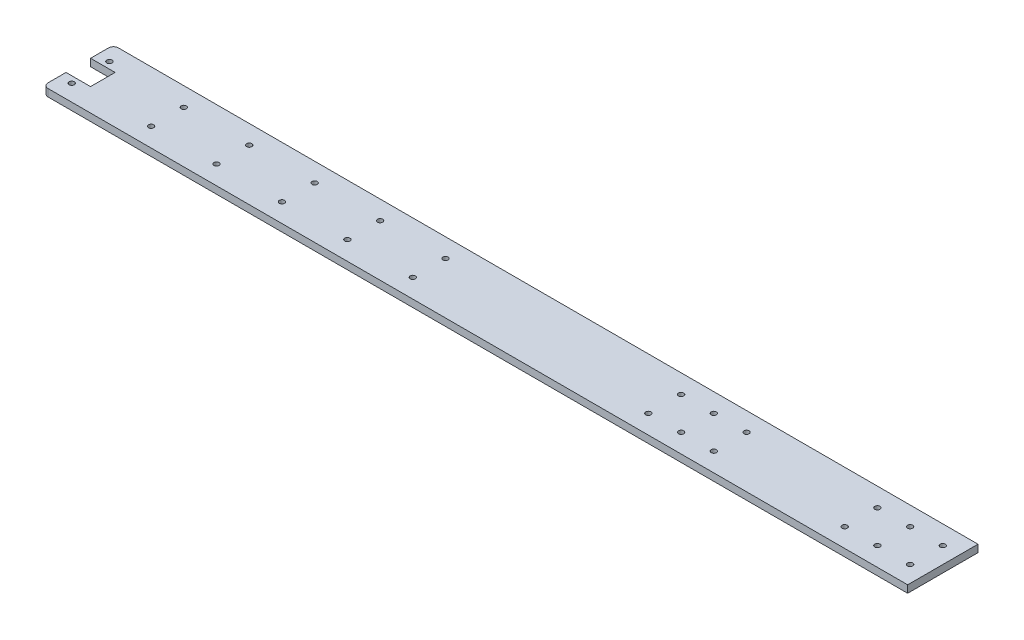
ISO-10303-21;
HEADER;
FILE_DESCRIPTION(('STEP AP214'),'2;1');
FILE_NAME('part.step','',(''),(''),'','','');
FILE_SCHEMA(('AUTOMOTIVE_DESIGN { 1 0 10303 214 1 1 1 1 }'));
ENDSEC;
DATA;
#1=APPLICATION_CONTEXT('core data for automotive mechanical design processes');
#2=APPLICATION_PROTOCOL_DEFINITION('international standard','automotive_design',2000,#1);
#3=PRODUCT_CONTEXT('',#1,'mechanical');
#4=PRODUCT('Part','Part','',(#3));
#5=PRODUCT_RELATED_PRODUCT_CATEGORY('part','',(#4));
#6=PRODUCT_DEFINITION_FORMATION('','',#4);
#7=PRODUCT_DEFINITION_CONTEXT('part definition',#1,'design');
#8=PRODUCT_DEFINITION('design','',#6,#7);
#9=PRODUCT_DEFINITION_SHAPE('','',#8);
#10=(LENGTH_UNIT() NAMED_UNIT(*) SI_UNIT(.MILLI.,.METRE.));
#11=(NAMED_UNIT(*) PLANE_ANGLE_UNIT() SI_UNIT($,.RADIAN.));
#12=(NAMED_UNIT(*) SI_UNIT($,.STERADIAN.) SOLID_ANGLE_UNIT());
#13=UNCERTAINTY_MEASURE_WITH_UNIT(LENGTH_MEASURE(1.E-05),#10,'distance_accuracy_value','');
#14=(GEOMETRIC_REPRESENTATION_CONTEXT(3) GLOBAL_UNCERTAINTY_ASSIGNED_CONTEXT((#13)) GLOBAL_UNIT_ASSIGNED_CONTEXT((#10,
#11,#12)) REPRESENTATION_CONTEXT('',''));
#15=CARTESIAN_POINT('',(0.,0.,0.));
#16=DIRECTION('',(0.,0.,1.));
#17=DIRECTION('',(1.,0.,0.));
#18=AXIS2_PLACEMENT_3D('',#15,#16,#17);
#19=CARTESIAN_POINT('',(-264.25,4.5,21.5000000000001));
#20=DIRECTION('',(1.,0.,0.));
#21=DIRECTION('',(0.,0.,-1.));
#22=AXIS2_PLACEMENT_3D('',#19,#20,#21);
#23=PLANE('',#22);
#24=DIRECTION('',(0.,0.,1.));
#25=VECTOR('',#24,1.);
#26=CARTESIAN_POINT('',(-264.25,4.5,21.5000000000001));
#27=LINE('',#26,#25);
#28=CARTESIAN_POINT('',(-264.25,4.5,-18.5000000000001));
#29=VERTEX_POINT('',#28);
#30=CARTESIAN_POINT('',(-264.25,4.5,-7.5));
#31=VERTEX_POINT('',#30);
#32=EDGE_CURVE('E294',#29,#31,#27,.T.);
#33=ORIENTED_EDGE('',*,*,#32,.F.);
#34=DIRECTION('',(0.,-1.,0.));
#35=VECTOR('',#34,1.);
#36=CARTESIAN_POINT('',(-264.25,4.5,-18.5000000000001));
#37=LINE('',#36,#35);
#38=CARTESIAN_POINT('',(-264.25,0.,-18.5000000000001));
#39=VERTEX_POINT('',#38);
#40=EDGE_CURVE('E41',#29,#39,#37,.T.);
#41=ORIENTED_EDGE('',*,*,#40,.T.);
#42=DIRECTION('',(0.,0.,1.));
#43=VECTOR('',#42,1.);
#44=CARTESIAN_POINT('',(-264.25,0.,21.5000000000001));
#45=LINE('',#44,#43);
#46=CARTESIAN_POINT('',(-264.25,0.,-7.5));
#47=VERTEX_POINT('',#46);
#48=EDGE_CURVE('E303',#39,#47,#45,.T.);
#49=ORIENTED_EDGE('',*,*,#48,.T.);
#50=DIRECTION('',(0.,1.,0.));
#51=VECTOR('',#50,1.);
#52=CARTESIAN_POINT('',(-264.25,0.,-7.5));
#53=LINE('',#52,#51);
#54=EDGE_CURVE('E149',#47,#31,#53,.T.);
#55=ORIENTED_EDGE('',*,*,#54,.T.);
#56=EDGE_LOOP('',(#33,#41,#49,#55));
#57=FACE_BOUND('',#56,.T.);
#58=ADVANCED_FACE('F33',(#57),#23,.F.);
#59=CARTESIAN_POINT('',(0.,4.5,0.));
#60=DIRECTION('',(0.,-1.,0.));
#61=DIRECTION('',(0.,0.,-1.));
#62=AXIS2_PLACEMENT_3D('',#59,#60,#61);
#63=PLANE('',#62);
#64=CARTESIAN_POINT('',(-256.75,4.5,11.5));
#65=DIRECTION('',(0.,1.,0.));
#66=DIRECTION('',(0.,0.,-1.));
#67=AXIS2_PLACEMENT_3D('',#64,#65,#66);
#68=CIRCLE('',#67,1.59999999999996);
#69=CARTESIAN_POINT('',(-256.75,4.5,9.90000000000004));
#70=VERTEX_POINT('',#69);
#71=EDGE_CURVE('E142',#70,#70,#68,.T.);
#72=ORIENTED_EDGE('',*,*,#71,.F.);
#73=EDGE_LOOP('',(#72));
#74=FACE_BOUND('',#73,.T.);
#75=CARTESIAN_POINT('',(-256.75,4.5,-11.5));
#76=DIRECTION('',(0.,1.,0.));
#77=DIRECTION('',(0.,0.,1.));
#78=AXIS2_PLACEMENT_3D('',#75,#76,#77);
#79=CIRCLE('',#78,1.59999999999996);
#80=CARTESIAN_POINT('',(-256.75,4.5,-9.90000000000004));
#81=VERTEX_POINT('',#80);
#82=EDGE_CURVE('E493',#81,#81,#79,.T.);
#83=ORIENTED_EDGE('',*,*,#82,.F.);
#84=EDGE_LOOP('',(#83));
#85=FACE_BOUND('',#84,.T.);
#86=CARTESIAN_POINT('',(-264.25,4.5,7.5));
#87=VERTEX_POINT('',#86);
#88=CARTESIAN_POINT('',(-264.25,4.5,18.5000000000001));
#89=VERTEX_POINT('',#88);
#90=EDGE_CURVE('E293',#87,#89,#27,.T.);
#91=ORIENTED_EDGE('',*,*,#90,.T.);
#92=CARTESIAN_POINT('',(-261.25,4.5,18.5000000000001));
#93=DIRECTION('',(0.,-1.,0.));
#94=DIRECTION('',(0.,0.,-1.));
#95=AXIS2_PLACEMENT_3D('',#92,#93,#94);
#96=CIRCLE('',#95,3.);
#97=CARTESIAN_POINT('',(-261.25,4.5,21.5000000000001));
#98=VERTEX_POINT('',#97);
#99=EDGE_CURVE('E321',#89,#98,#96,.F.);
#100=ORIENTED_EDGE('',*,*,#99,.T.);
#101=DIRECTION('',(1.,0.,0.));
#102=VECTOR('',#101,1.);
#103=CARTESIAN_POINT('',(-264.25,4.5,21.5000000000001));
#104=LINE('',#103,#102);
#105=CARTESIAN_POINT('',(264.25,4.5,21.5000000000001));
#106=VERTEX_POINT('',#105);
#107=EDGE_CURVE('E296',#98,#106,#104,.T.);
#108=ORIENTED_EDGE('',*,*,#107,.T.);
#109=DIRECTION('',(0.,0.,-1.));
#110=VECTOR('',#109,1.);
#111=CARTESIAN_POINT('',(264.25,4.5,21.5000000000001));
#112=LINE('',#111,#110);
#113=CARTESIAN_POINT('',(264.25,4.5,-21.4999999999999));
#114=VERTEX_POINT('',#113);
#115=EDGE_CURVE('E287',#106,#114,#112,.T.);
#116=ORIENTED_EDGE('',*,*,#115,.T.);
#117=DIRECTION('',(-1.,0.,0.));
#118=VECTOR('',#117,1.);
#119=CARTESIAN_POINT('',(-264.25,4.5,-21.5000000000001));
#120=LINE('',#119,#118);
#121=CARTESIAN_POINT('',(-261.25,4.5,-21.5000000000001));
#122=VERTEX_POINT('',#121);
#123=EDGE_CURVE('E290',#114,#122,#120,.T.);
#124=ORIENTED_EDGE('',*,*,#123,.T.);
#125=CARTESIAN_POINT('',(-261.25,4.5,-18.5000000000001));
#126=DIRECTION('',(0.,-1.,0.));
#127=DIRECTION('',(0.,0.,-1.));
#128=AXIS2_PLACEMENT_3D('',#125,#126,#127);
#129=CIRCLE('',#128,3.);
#130=EDGE_CURVE('E53',#122,#29,#129,.F.);
#131=ORIENTED_EDGE('',*,*,#130,.T.);
#132=ORIENTED_EDGE('',*,*,#32,.T.);
#133=DIRECTION('',(-1.,0.,0.));
#134=VECTOR('',#133,1.);
#135=CARTESIAN_POINT('',(-264.25,4.5,-7.5));
#136=LINE('',#135,#134);
#137=CARTESIAN_POINT('',(-249.25,4.5,-7.5));
#138=VERTEX_POINT('',#137);
#139=EDGE_CURVE('E136',#138,#31,#136,.T.);
#140=ORIENTED_EDGE('',*,*,#139,.F.);
#141=DIRECTION('',(0.,0.,-1.));
#142=VECTOR('',#141,1.);
#143=CARTESIAN_POINT('',(-249.25,4.5,7.5));
#144=LINE('',#143,#142);
#145=CARTESIAN_POINT('',(-249.25,4.5,7.5));
#146=VERTEX_POINT('',#145);
#147=EDGE_CURVE('E139',#146,#138,#144,.T.);
#148=ORIENTED_EDGE('',*,*,#147,.F.);
#149=DIRECTION('',(1.,0.,0.));
#150=VECTOR('',#149,1.);
#151=CARTESIAN_POINT('',(-264.25,4.5,7.5));
#152=LINE('',#151,#150);
#153=EDGE_CURVE('E115',#87,#146,#152,.T.);
#154=ORIENTED_EDGE('',*,*,#153,.F.);
#155=EDGE_LOOP('',(#91,#100,#108,#116,#124,#131,#132,#140,#148,#154));
#156=FACE_BOUND('',#155,.T.);
#157=CARTESIAN_POINT('',(-209.75,4.5,-10.));
#158=DIRECTION('',(0.,1.,0.));
#159=DIRECTION('',(0.,0.,1.));
#160=AXIS2_PLACEMENT_3D('',#157,#158,#159);
#161=CIRCLE('',#160,1.59999999999999);
#162=CARTESIAN_POINT('',(-209.75,4.5,-8.40000000000001));
#163=VERTEX_POINT('',#162);
#164=EDGE_CURVE('E281',#163,#163,#161,.T.);
#165=ORIENTED_EDGE('',*,*,#164,.F.);
#166=EDGE_LOOP('',(#165));
#167=FACE_BOUND('',#166,.T.);
#168=CARTESIAN_POINT('',(234.25,4.5,-10.));
#169=DIRECTION('',(0.,1.,0.));
#170=DIRECTION('',(0.,0.,1.));
#171=AXIS2_PLACEMENT_3D('',#168,#169,#170);
#172=CIRCLE('',#171,1.59999999999999);
#173=CARTESIAN_POINT('',(234.25,4.5,-8.40000000000001));
#174=VERTEX_POINT('',#173);
#175=EDGE_CURVE('E275',#174,#174,#172,.T.);
#176=ORIENTED_EDGE('',*,*,#175,.F.);
#177=EDGE_LOOP('',(#176));
#178=FACE_BOUND('',#177,.T.);
#179=CARTESIAN_POINT('',(-169.75,4.5,-10.));
#180=DIRECTION('',(0.,1.,0.));
#181=DIRECTION('',(0.,0.,1.));
#182=AXIS2_PLACEMENT_3D('',#179,#180,#181);
#183=CIRCLE('',#182,1.59999999999999);
#184=CARTESIAN_POINT('',(-169.75,4.5,-8.40000000000001));
#185=VERTEX_POINT('',#184);
#186=EDGE_CURVE('E269',#185,#185,#183,.T.);
#187=ORIENTED_EDGE('',*,*,#186,.F.);
#188=EDGE_LOOP('',(#187));
#189=FACE_BOUND('',#188,.T.);
#190=CARTESIAN_POINT('',(-129.75,4.5,-10.));
#191=DIRECTION('',(0.,1.,0.));
#192=DIRECTION('',(0.,0.,1.));
#193=AXIS2_PLACEMENT_3D('',#190,#191,#192);
#194=CIRCLE('',#193,1.60000000000002);
#195=CARTESIAN_POINT('',(-129.75,4.5,-8.39999999999998));
#196=VERTEX_POINT('',#195);
#197=EDGE_CURVE('E263',#196,#196,#194,.T.);
#198=ORIENTED_EDGE('',*,*,#197,.F.);
#199=EDGE_LOOP('',(#198));
#200=FACE_BOUND('',#199,.T.);
#201=CARTESIAN_POINT('',(-89.7500000000001,4.5,-10.));
#202=DIRECTION('',(0.,1.,0.));
#203=DIRECTION('',(0.,0.,1.));
#204=AXIS2_PLACEMENT_3D('',#201,#202,#203);
#205=CIRCLE('',#204,1.59999999999999);
#206=CARTESIAN_POINT('',(-89.7500000000001,4.5,-8.40000000000001));
#207=VERTEX_POINT('',#206);
#208=EDGE_CURVE('E257',#207,#207,#205,.T.);
#209=ORIENTED_EDGE('',*,*,#208,.F.);
#210=EDGE_LOOP('',(#209));
#211=FACE_BOUND('',#210,.T.);
#212=CARTESIAN_POINT('',(-49.7500000000001,4.5,-10.));
#213=DIRECTION('',(0.,1.,0.));
#214=DIRECTION('',(0.,0.,1.));
#215=AXIS2_PLACEMENT_3D('',#212,#213,#214);
#216=CIRCLE('',#215,1.59999999999996);
#217=CARTESIAN_POINT('',(-49.7500000000001,4.5,-8.40000000000004));
#218=VERTEX_POINT('',#217);
#219=EDGE_CURVE('E251',#218,#218,#216,.T.);
#220=ORIENTED_EDGE('',*,*,#219,.F.);
#221=EDGE_LOOP('',(#220));
#222=FACE_BOUND('',#221,.T.);
#223=CARTESIAN_POINT('',(254.25,4.5,-10.));
#224=DIRECTION('',(0.,1.,0.));
#225=DIRECTION('',(0.,0.,1.));
#226=AXIS2_PLACEMENT_3D('',#223,#224,#225);
#227=CIRCLE('',#226,1.59999999999996);
#228=CARTESIAN_POINT('',(254.25,4.5,-8.40000000000004));
#229=VERTEX_POINT('',#228);
#230=EDGE_CURVE('E245',#229,#229,#227,.T.);
#231=ORIENTED_EDGE('',*,*,#230,.F.);
#232=EDGE_LOOP('',(#231));
#233=FACE_BOUND('',#232,.T.);
#234=CARTESIAN_POINT('',(-169.75,4.5,10.));
#235=DIRECTION('',(0.,1.,0.));
#236=DIRECTION('',(0.,0.,1.));
#237=AXIS2_PLACEMENT_3D('',#234,#235,#236);
#238=CIRCLE('',#237,1.59999999999996);
#239=CARTESIAN_POINT('',(-169.75,4.5,11.6));
#240=VERTEX_POINT('',#239);
#241=EDGE_CURVE('E239',#240,#240,#238,.T.);
#242=ORIENTED_EDGE('',*,*,#241,.F.);
#243=EDGE_LOOP('',(#242));
#244=FACE_BOUND('',#243,.T.);
#245=CARTESIAN_POINT('',(-129.75,4.5,10.));
#246=DIRECTION('',(0.,1.,0.));
#247=DIRECTION('',(0.,0.,1.));
#248=AXIS2_PLACEMENT_3D('',#245,#246,#247);
#249=CIRCLE('',#248,1.60000000000002);
#250=CARTESIAN_POINT('',(-129.75,4.5,11.6));
#251=VERTEX_POINT('',#250);
#252=EDGE_CURVE('E233',#251,#251,#249,.T.);
#253=ORIENTED_EDGE('',*,*,#252,.F.);
#254=EDGE_LOOP('',(#253));
#255=FACE_BOUND('',#254,.T.);
#256=CARTESIAN_POINT('',(-89.7499999999995,4.5,10.));
#257=DIRECTION('',(0.,1.,0.));
#258=DIRECTION('',(0.,0.,1.));
#259=AXIS2_PLACEMENT_3D('',#256,#257,#258);
#260=CIRCLE('',#259,1.59999999999996);
#261=CARTESIAN_POINT('',(-89.7499999999995,4.5,11.6));
#262=VERTEX_POINT('',#261);
#263=EDGE_CURVE('E227',#262,#262,#260,.T.);
#264=ORIENTED_EDGE('',*,*,#263,.F.);
#265=EDGE_LOOP('',(#264));
#266=FACE_BOUND('',#265,.T.);
#267=CARTESIAN_POINT('',(-49.7499999999996,4.5,10.));
#268=DIRECTION('',(0.,1.,0.));
#269=DIRECTION('',(0.,0.,1.));
#270=AXIS2_PLACEMENT_3D('',#267,#268,#269);
#271=CIRCLE('',#270,1.59999999999999);
#272=CARTESIAN_POINT('',(-49.7499999999996,4.5,11.6));
#273=VERTEX_POINT('',#272);
#274=EDGE_CURVE('E221',#273,#273,#271,.T.);
#275=ORIENTED_EDGE('',*,*,#274,.F.);
#276=EDGE_LOOP('',(#275));
#277=FACE_BOUND('',#276,.T.);
#278=CARTESIAN_POINT('',(134.25,4.5,-9.99999999999751));
#279=DIRECTION('',(0.,1.,0.));
#280=DIRECTION('',(0.,0.,1.));
#281=AXIS2_PLACEMENT_3D('',#278,#279,#280);
#282=CIRCLE('',#281,1.59999999999999);
#283=CARTESIAN_POINT('',(134.25,4.5,-8.39999999999752));
#284=VERTEX_POINT('',#283);
#285=EDGE_CURVE('E215',#284,#284,#282,.T.);
#286=ORIENTED_EDGE('',*,*,#285,.F.);
#287=EDGE_LOOP('',(#286));
#288=FACE_BOUND('',#287,.T.);
#289=CARTESIAN_POINT('',(134.25,4.5,10.0000000000025));
#290=DIRECTION('',(0.,1.,0.));
#291=DIRECTION('',(0.,0.,1.));
#292=AXIS2_PLACEMENT_3D('',#289,#290,#291);
#293=CIRCLE('',#292,1.59999999999999);
#294=CARTESIAN_POINT('',(134.25,4.5,11.6000000000025));
#295=VERTEX_POINT('',#294);
#296=EDGE_CURVE('E209',#295,#295,#293,.T.);
#297=ORIENTED_EDGE('',*,*,#296,.F.);
#298=EDGE_LOOP('',(#297));
#299=FACE_BOUND('',#298,.T.);
#300=CARTESIAN_POINT('',(-209.749999999999,4.5,10.));
#301=DIRECTION('',(0.,1.,0.));
#302=DIRECTION('',(0.,0.,1.));
#303=AXIS2_PLACEMENT_3D('',#300,#301,#302);
#304=CIRCLE('',#303,1.59999999999999);
#305=CARTESIAN_POINT('',(-209.749999999999,4.5,11.6));
#306=VERTEX_POINT('',#305);
#307=EDGE_CURVE('E203',#306,#306,#304,.T.);
#308=ORIENTED_EDGE('',*,*,#307,.F.);
#309=EDGE_LOOP('',(#308));
#310=FACE_BOUND('',#309,.T.);
#311=CARTESIAN_POINT('',(114.25,4.5,-9.99999999999751));
#312=DIRECTION('',(0.,1.,0.));
#313=DIRECTION('',(0.,0.,1.));
#314=AXIS2_PLACEMENT_3D('',#311,#312,#313);
#315=CIRCLE('',#314,1.59999999999999);
#316=CARTESIAN_POINT('',(114.25,4.5,-8.39999999999752));
#317=VERTEX_POINT('',#316);
#318=EDGE_CURVE('E197',#317,#317,#315,.T.);
#319=ORIENTED_EDGE('',*,*,#318,.F.);
#320=EDGE_LOOP('',(#319));
#321=FACE_BOUND('',#320,.T.);
#322=CARTESIAN_POINT('',(114.25,4.5,10.0000000000025));
#323=DIRECTION('',(0.,1.,0.));
#324=DIRECTION('',(0.,0.,1.));
#325=AXIS2_PLACEMENT_3D('',#322,#323,#324);
#326=CIRCLE('',#325,1.59999999999999);
#327=CARTESIAN_POINT('',(114.25,4.5,11.6000000000025));
#328=VERTEX_POINT('',#327);
#329=EDGE_CURVE('E191',#328,#328,#326,.T.);
#330=ORIENTED_EDGE('',*,*,#329,.F.);
#331=EDGE_LOOP('',(#330));
#332=FACE_BOUND('',#331,.T.);
#333=CARTESIAN_POINT('',(234.25,4.5,9.99999999999999));
#334=DIRECTION('',(0.,1.,0.));
#335=DIRECTION('',(0.,0.,1.));
#336=AXIS2_PLACEMENT_3D('',#333,#334,#335);
#337=CIRCLE('',#336,1.59999999999999);
#338=CARTESIAN_POINT('',(234.25,4.5,11.6));
#339=VERTEX_POINT('',#338);
#340=EDGE_CURVE('E185',#339,#339,#337,.T.);
#341=ORIENTED_EDGE('',*,*,#340,.F.);
#342=EDGE_LOOP('',(#341));
#343=FACE_BOUND('',#342,.T.);
#344=CARTESIAN_POINT('',(254.25,4.5,9.99999999999999));
#345=DIRECTION('',(0.,1.,0.));
#346=DIRECTION('',(0.,0.,1.));
#347=AXIS2_PLACEMENT_3D('',#344,#345,#346);
#348=CIRCLE('',#347,1.59999999999996);
#349=CARTESIAN_POINT('',(254.25,4.5,11.6));
#350=VERTEX_POINT('',#349);
#351=EDGE_CURVE('E179',#350,#350,#348,.T.);
#352=ORIENTED_EDGE('',*,*,#351,.F.);
#353=EDGE_LOOP('',(#352));
#354=FACE_BOUND('',#353,.T.);
#355=CARTESIAN_POINT('',(214.25,4.5,-9.99999999999986));
#356=DIRECTION('',(0.,1.,0.));
#357=DIRECTION('',(0.,0.,1.));
#358=AXIS2_PLACEMENT_3D('',#355,#356,#357);
#359=CIRCLE('',#358,1.59999999999999);
#360=CARTESIAN_POINT('',(214.25,4.5,-8.39999999999987));
#361=VERTEX_POINT('',#360);
#362=EDGE_CURVE('E173',#361,#361,#359,.T.);
#363=ORIENTED_EDGE('',*,*,#362,.F.);
#364=EDGE_LOOP('',(#363));
#365=FACE_BOUND('',#364,.T.);
#366=CARTESIAN_POINT('',(94.25,4.5,-9.99999999999737));
#367=DIRECTION('',(0.,1.,0.));
#368=DIRECTION('',(0.,0.,1.));
#369=AXIS2_PLACEMENT_3D('',#366,#367,#368);
#370=CIRCLE('',#369,1.59999999999999);
#371=CARTESIAN_POINT('',(94.25,4.5,-8.39999999999738));
#372=VERTEX_POINT('',#371);
#373=EDGE_CURVE('E167',#372,#372,#370,.T.);
#374=ORIENTED_EDGE('',*,*,#373,.F.);
#375=EDGE_LOOP('',(#374));
#376=FACE_BOUND('',#375,.T.);
#377=CARTESIAN_POINT('',(94.2500000000005,4.5,10.0000000000026));
#378=DIRECTION('',(0.,1.,0.));
#379=DIRECTION('',(0.,0.,1.));
#380=AXIS2_PLACEMENT_3D('',#377,#378,#379);
#381=CIRCLE('',#380,1.59999999999999);
#382=CARTESIAN_POINT('',(94.2500000000005,4.5,11.6000000000026));
#383=VERTEX_POINT('',#382);
#384=EDGE_CURVE('E161',#383,#383,#381,.T.);
#385=ORIENTED_EDGE('',*,*,#384,.F.);
#386=EDGE_LOOP('',(#385));
#387=FACE_BOUND('',#386,.T.);
#388=CARTESIAN_POINT('',(214.25,4.5,10.0000000000001));
#389=DIRECTION('',(0.,1.,0.));
#390=DIRECTION('',(0.,0.,1.));
#391=AXIS2_PLACEMENT_3D('',#388,#389,#390);
#392=CIRCLE('',#391,1.59999999999999);
#393=CARTESIAN_POINT('',(214.25,4.5,11.6000000000001));
#394=VERTEX_POINT('',#393);
#395=EDGE_CURVE('E155',#394,#394,#392,.T.);
#396=ORIENTED_EDGE('',*,*,#395,.F.);
#397=EDGE_LOOP('',(#396));
#398=FACE_BOUND('',#397,.T.);
#399=ADVANCED_FACE('F332',(#74,#85,#156,#167,#178,#189,#200,#211,#222,#233,#244,#255,#266,#277,
#288,#299,#310,#321,#332,#343,#354,#365,#376,#387,#398),#63,.F.);
#400=CARTESIAN_POINT('',(0.,0.,0.));
#401=DIRECTION('',(0.,-1.,0.));
#402=DIRECTION('',(0.,0.,-1.));
#403=AXIS2_PLACEMENT_3D('',#400,#401,#402);
#404=PLANE('',#403);
#405=CARTESIAN_POINT('',(-256.75,0.,11.5));
#406=DIRECTION('',(0.,1.,0.));
#407=DIRECTION('',(0.,0.,-1.));
#408=AXIS2_PLACEMENT_3D('',#405,#406,#407);
#409=CIRCLE('',#408,1.59999999999996);
#410=CARTESIAN_POINT('',(-256.75,0.,9.90000000000004));
#411=VERTEX_POINT('',#410);
#412=EDGE_CURVE('E495',#411,#411,#409,.T.);
#413=ORIENTED_EDGE('',*,*,#412,.T.);
#414=EDGE_LOOP('',(#413));
#415=FACE_BOUND('',#414,.T.);
#416=CARTESIAN_POINT('',(-256.75,0.,-11.5));
#417=DIRECTION('',(0.,1.,0.));
#418=DIRECTION('',(0.,0.,1.));
#419=AXIS2_PLACEMENT_3D('',#416,#417,#418);
#420=CIRCLE('',#419,1.59999999999996);
#421=CARTESIAN_POINT('',(-256.75,0.,-9.90000000000004));
#422=VERTEX_POINT('',#421);
#423=EDGE_CURVE('E147',#422,#422,#420,.T.);
#424=ORIENTED_EDGE('',*,*,#423,.T.);
#425=EDGE_LOOP('',(#424));
#426=FACE_BOUND('',#425,.T.);
#427=DIRECTION('',(1.,0.,0.));
#428=VECTOR('',#427,1.);
#429=CARTESIAN_POINT('',(-264.25,0.,21.5000000000001));
#430=LINE('',#429,#428);
#431=CARTESIAN_POINT('',(-261.25,0.,21.5000000000001));
#432=VERTEX_POINT('',#431);
#433=CARTESIAN_POINT('',(264.25,0.,21.5000000000001));
#434=VERTEX_POINT('',#433);
#435=EDGE_CURVE('E291',#432,#434,#430,.T.);
#436=ORIENTED_EDGE('',*,*,#435,.F.);
#437=CARTESIAN_POINT('',(-261.25,0.,18.5000000000001));
#438=DIRECTION('',(0.,-1.,0.));
#439=DIRECTION('',(0.,0.,-1.));
#440=AXIS2_PLACEMENT_3D('',#437,#438,#439);
#441=CIRCLE('',#440,3.);
#442=CARTESIAN_POINT('',(-264.25,0.,18.5000000000001));
#443=VERTEX_POINT('',#442);
#444=EDGE_CURVE('E316',#432,#443,#441,.T.);
#445=ORIENTED_EDGE('',*,*,#444,.T.);
#446=CARTESIAN_POINT('',(-264.25,0.,7.5));
#447=VERTEX_POINT('',#446);
#448=EDGE_CURVE('E135',#447,#443,#45,.T.);
#449=ORIENTED_EDGE('',*,*,#448,.F.);
#450=DIRECTION('',(1.,0.,0.));
#451=VECTOR('',#450,1.);
#452=CARTESIAN_POINT('',(-264.25,0.,7.5));
#453=LINE('',#452,#451);
#454=CARTESIAN_POINT('',(-249.25,0.,7.5));
#455=VERTEX_POINT('',#454);
#456=EDGE_CURVE('E112',#447,#455,#453,.T.);
#457=ORIENTED_EDGE('',*,*,#456,.T.);
#458=DIRECTION('',(0.,0.,-1.));
#459=VECTOR('',#458,1.);
#460=CARTESIAN_POINT('',(-249.25,0.,7.5));
#461=LINE('',#460,#459);
#462=CARTESIAN_POINT('',(-249.25,0.,-7.5));
#463=VERTEX_POINT('',#462);
#464=EDGE_CURVE('E123',#455,#463,#461,.T.);
#465=ORIENTED_EDGE('',*,*,#464,.T.);
#466=DIRECTION('',(-1.,0.,0.));
#467=VECTOR('',#466,1.);
#468=CARTESIAN_POINT('',(-264.25,0.,-7.5));
#469=LINE('',#468,#467);
#470=EDGE_CURVE('E128',#463,#47,#469,.T.);
#471=ORIENTED_EDGE('',*,*,#470,.T.);
#472=ORIENTED_EDGE('',*,*,#48,.F.);
#473=CARTESIAN_POINT('',(-261.25,0.,-18.5000000000001));
#474=DIRECTION('',(0.,-1.,0.));
#475=DIRECTION('',(0.,0.,-1.));
#476=AXIS2_PLACEMENT_3D('',#473,#474,#475);
#477=CIRCLE('',#476,3.);
#478=CARTESIAN_POINT('',(-261.25,0.,-21.5000000000001));
#479=VERTEX_POINT('',#478);
#480=EDGE_CURVE('E314',#39,#479,#477,.T.);
#481=ORIENTED_EDGE('',*,*,#480,.T.);
#482=DIRECTION('',(-1.,0.,0.));
#483=VECTOR('',#482,1.);
#484=CARTESIAN_POINT('',(-264.25,0.,-21.5000000000001));
#485=LINE('',#484,#483);
#486=CARTESIAN_POINT('',(264.25,0.,-21.4999999999999));
#487=VERTEX_POINT('',#486);
#488=EDGE_CURVE('E301',#487,#479,#485,.T.);
#489=ORIENTED_EDGE('',*,*,#488,.F.);
#490=DIRECTION('',(0.,0.,-1.));
#491=VECTOR('',#490,1.);
#492=CARTESIAN_POINT('',(264.25,0.,21.5000000000001));
#493=LINE('',#492,#491);
#494=EDGE_CURVE('E284',#434,#487,#493,.T.);
#495=ORIENTED_EDGE('',*,*,#494,.F.);
#496=EDGE_LOOP('',(#436,#445,#449,#457,#465,#471,#472,#481,#489,#495));
#497=FACE_BOUND('',#496,.T.);
#498=CARTESIAN_POINT('',(94.2500000000005,0.,10.0000000000026));
#499=DIRECTION('',(0.,1.,0.));
#500=DIRECTION('',(0.,0.,1.));
#501=AXIS2_PLACEMENT_3D('',#498,#499,#500);
#502=CIRCLE('',#501,1.59999999999999);
#503=CARTESIAN_POINT('',(94.2500000000005,0.,11.6000000000026));
#504=VERTEX_POINT('',#503);
#505=EDGE_CURVE('E158',#504,#504,#502,.T.);
#506=ORIENTED_EDGE('',*,*,#505,.T.);
#507=EDGE_LOOP('',(#506));
#508=FACE_BOUND('',#507,.T.);
#509=CARTESIAN_POINT('',(214.25,0.,-9.99999999999986));
#510=DIRECTION('',(0.,1.,0.));
#511=DIRECTION('',(0.,0.,1.));
#512=AXIS2_PLACEMENT_3D('',#509,#510,#511);
#513=CIRCLE('',#512,1.59999999999999);
#514=CARTESIAN_POINT('',(214.25,0.,-8.39999999999987));
#515=VERTEX_POINT('',#514);
#516=EDGE_CURVE('E170',#515,#515,#513,.T.);
#517=ORIENTED_EDGE('',*,*,#516,.T.);
#518=EDGE_LOOP('',(#517));
#519=FACE_BOUND('',#518,.T.);
#520=CARTESIAN_POINT('',(234.25,0.,9.99999999999999));
#521=DIRECTION('',(0.,1.,0.));
#522=DIRECTION('',(0.,0.,1.));
#523=AXIS2_PLACEMENT_3D('',#520,#521,#522);
#524=CIRCLE('',#523,1.59999999999999);
#525=CARTESIAN_POINT('',(234.25,0.,11.6));
#526=VERTEX_POINT('',#525);
#527=EDGE_CURVE('E182',#526,#526,#524,.T.);
#528=ORIENTED_EDGE('',*,*,#527,.T.);
#529=EDGE_LOOP('',(#528));
#530=FACE_BOUND('',#529,.T.);
#531=CARTESIAN_POINT('',(114.25,0.,-9.99999999999751));
#532=DIRECTION('',(0.,1.,0.));
#533=DIRECTION('',(0.,0.,1.));
#534=AXIS2_PLACEMENT_3D('',#531,#532,#533);
#535=CIRCLE('',#534,1.59999999999999);
#536=CARTESIAN_POINT('',(114.25,0.,-8.39999999999752));
#537=VERTEX_POINT('',#536);
#538=EDGE_CURVE('E194',#537,#537,#535,.T.);
#539=ORIENTED_EDGE('',*,*,#538,.T.);
#540=EDGE_LOOP('',(#539));
#541=FACE_BOUND('',#540,.T.);
#542=CARTESIAN_POINT('',(134.25,0.,10.0000000000025));
#543=DIRECTION('',(0.,1.,0.));
#544=DIRECTION('',(0.,0.,1.));
#545=AXIS2_PLACEMENT_3D('',#542,#543,#544);
#546=CIRCLE('',#545,1.59999999999999);
#547=CARTESIAN_POINT('',(134.25,0.,11.6000000000025));
#548=VERTEX_POINT('',#547);
#549=EDGE_CURVE('E206',#548,#548,#546,.T.);
#550=ORIENTED_EDGE('',*,*,#549,.T.);
#551=EDGE_LOOP('',(#550));
#552=FACE_BOUND('',#551,.T.);
#553=CARTESIAN_POINT('',(-49.7499999999996,0.,10.));
#554=DIRECTION('',(0.,1.,0.));
#555=DIRECTION('',(0.,0.,1.));
#556=AXIS2_PLACEMENT_3D('',#553,#554,#555);
#557=CIRCLE('',#556,1.59999999999999);
#558=CARTESIAN_POINT('',(-49.7499999999996,0.,11.6));
#559=VERTEX_POINT('',#558);
#560=EDGE_CURVE('E218',#559,#559,#557,.T.);
#561=ORIENTED_EDGE('',*,*,#560,.T.);
#562=EDGE_LOOP('',(#561));
#563=FACE_BOUND('',#562,.T.);
#564=CARTESIAN_POINT('',(-129.75,0.,10.));
#565=DIRECTION('',(0.,1.,0.));
#566=DIRECTION('',(0.,0.,1.));
#567=AXIS2_PLACEMENT_3D('',#564,#565,#566);
#568=CIRCLE('',#567,1.60000000000002);
#569=CARTESIAN_POINT('',(-129.75,0.,11.6));
#570=VERTEX_POINT('',#569);
#571=EDGE_CURVE('E230',#570,#570,#568,.T.);
#572=ORIENTED_EDGE('',*,*,#571,.T.);
#573=EDGE_LOOP('',(#572));
#574=FACE_BOUND('',#573,.T.);
#575=CARTESIAN_POINT('',(254.25,0.,-10.));
#576=DIRECTION('',(0.,1.,0.));
#577=DIRECTION('',(0.,0.,1.));
#578=AXIS2_PLACEMENT_3D('',#575,#576,#577);
#579=CIRCLE('',#578,1.59999999999996);
#580=CARTESIAN_POINT('',(254.25,0.,-8.40000000000004));
#581=VERTEX_POINT('',#580);
#582=EDGE_CURVE('E242',#581,#581,#579,.T.);
#583=ORIENTED_EDGE('',*,*,#582,.T.);
#584=EDGE_LOOP('',(#583));
#585=FACE_BOUND('',#584,.T.);
#586=CARTESIAN_POINT('',(-89.7500000000001,0.,-10.));
#587=DIRECTION('',(0.,1.,0.));
#588=DIRECTION('',(0.,0.,1.));
#589=AXIS2_PLACEMENT_3D('',#586,#587,#588);
#590=CIRCLE('',#589,1.59999999999999);
#591=CARTESIAN_POINT('',(-89.7500000000001,0.,-8.40000000000001));
#592=VERTEX_POINT('',#591);
#593=EDGE_CURVE('E254',#592,#592,#590,.T.);
#594=ORIENTED_EDGE('',*,*,#593,.T.);
#595=EDGE_LOOP('',(#594));
#596=FACE_BOUND('',#595,.T.);
#597=CARTESIAN_POINT('',(-169.75,0.,-10.));
#598=DIRECTION('',(0.,1.,0.));
#599=DIRECTION('',(0.,0.,1.));
#600=AXIS2_PLACEMENT_3D('',#597,#598,#599);
#601=CIRCLE('',#600,1.59999999999999);
#602=CARTESIAN_POINT('',(-169.75,0.,-8.40000000000001));
#603=VERTEX_POINT('',#602);
#604=EDGE_CURVE('E266',#603,#603,#601,.T.);
#605=ORIENTED_EDGE('',*,*,#604,.T.);
#606=EDGE_LOOP('',(#605));
#607=FACE_BOUND('',#606,.T.);
#608=CARTESIAN_POINT('',(-209.75,0.,-10.));
#609=DIRECTION('',(0.,1.,0.));
#610=DIRECTION('',(0.,0.,1.));
#611=AXIS2_PLACEMENT_3D('',#608,#609,#610);
#612=CIRCLE('',#611,1.59999999999999);
#613=CARTESIAN_POINT('',(-209.75,0.,-8.40000000000001));
#614=VERTEX_POINT('',#613);
#615=EDGE_CURVE('E278',#614,#614,#612,.T.);
#616=ORIENTED_EDGE('',*,*,#615,.T.);
#617=EDGE_LOOP('',(#616));
#618=FACE_BOUND('',#617,.T.);
#619=CARTESIAN_POINT('',(234.25,0.,-10.));
#620=DIRECTION('',(0.,1.,0.));
#621=DIRECTION('',(0.,0.,1.));
#622=AXIS2_PLACEMENT_3D('',#619,#620,#621);
#623=CIRCLE('',#622,1.59999999999999);
#624=CARTESIAN_POINT('',(234.25,0.,-8.40000000000001));
#625=VERTEX_POINT('',#624);
#626=EDGE_CURVE('E272',#625,#625,#623,.T.);
#627=ORIENTED_EDGE('',*,*,#626,.T.);
#628=EDGE_LOOP('',(#627));
#629=FACE_BOUND('',#628,.T.);
#630=CARTESIAN_POINT('',(-129.75,0.,-10.));
#631=DIRECTION('',(0.,1.,0.));
#632=DIRECTION('',(0.,0.,1.));
#633=AXIS2_PLACEMENT_3D('',#630,#631,#632);
#634=CIRCLE('',#633,1.60000000000002);
#635=CARTESIAN_POINT('',(-129.75,0.,-8.39999999999998));
#636=VERTEX_POINT('',#635);
#637=EDGE_CURVE('E260',#636,#636,#634,.T.);
#638=ORIENTED_EDGE('',*,*,#637,.T.);
#639=EDGE_LOOP('',(#638));
#640=FACE_BOUND('',#639,.T.);
#641=CARTESIAN_POINT('',(-49.7500000000001,0.,-10.));
#642=DIRECTION('',(0.,1.,0.));
#643=DIRECTION('',(0.,0.,1.));
#644=AXIS2_PLACEMENT_3D('',#641,#642,#643);
#645=CIRCLE('',#644,1.59999999999996);
#646=CARTESIAN_POINT('',(-49.7500000000001,0.,-8.40000000000004));
#647=VERTEX_POINT('',#646);
#648=EDGE_CURVE('E248',#647,#647,#645,.T.);
#649=ORIENTED_EDGE('',*,*,#648,.T.);
#650=EDGE_LOOP('',(#649));
#651=FACE_BOUND('',#650,.T.);
#652=CARTESIAN_POINT('',(-169.75,0.,10.));
#653=DIRECTION('',(0.,1.,0.));
#654=DIRECTION('',(0.,0.,1.));
#655=AXIS2_PLACEMENT_3D('',#652,#653,#654);
#656=CIRCLE('',#655,1.59999999999996);
#657=CARTESIAN_POINT('',(-169.75,0.,11.6));
#658=VERTEX_POINT('',#657);
#659=EDGE_CURVE('E236',#658,#658,#656,.T.);
#660=ORIENTED_EDGE('',*,*,#659,.T.);
#661=EDGE_LOOP('',(#660));
#662=FACE_BOUND('',#661,.T.);
#663=CARTESIAN_POINT('',(-89.7499999999995,0.,10.));
#664=DIRECTION('',(0.,1.,0.));
#665=DIRECTION('',(0.,0.,1.));
#666=AXIS2_PLACEMENT_3D('',#663,#664,#665);
#667=CIRCLE('',#666,1.59999999999996);
#668=CARTESIAN_POINT('',(-89.7499999999995,0.,11.6));
#669=VERTEX_POINT('',#668);
#670=EDGE_CURVE('E224',#669,#669,#667,.T.);
#671=ORIENTED_EDGE('',*,*,#670,.T.);
#672=EDGE_LOOP('',(#671));
#673=FACE_BOUND('',#672,.T.);
#674=CARTESIAN_POINT('',(134.25,0.,-9.99999999999751));
#675=DIRECTION('',(0.,1.,0.));
#676=DIRECTION('',(0.,0.,1.));
#677=AXIS2_PLACEMENT_3D('',#674,#675,#676);
#678=CIRCLE('',#677,1.59999999999999);
#679=CARTESIAN_POINT('',(134.25,0.,-8.39999999999752));
#680=VERTEX_POINT('',#679);
#681=EDGE_CURVE('E212',#680,#680,#678,.T.);
#682=ORIENTED_EDGE('',*,*,#681,.T.);
#683=EDGE_LOOP('',(#682));
#684=FACE_BOUND('',#683,.T.);
#685=CARTESIAN_POINT('',(-209.749999999999,0.,10.));
#686=DIRECTION('',(0.,1.,0.));
#687=DIRECTION('',(0.,0.,1.));
#688=AXIS2_PLACEMENT_3D('',#685,#686,#687);
#689=CIRCLE('',#688,1.59999999999999);
#690=CARTESIAN_POINT('',(-209.749999999999,0.,11.6));
#691=VERTEX_POINT('',#690);
#692=EDGE_CURVE('E200',#691,#691,#689,.T.);
#693=ORIENTED_EDGE('',*,*,#692,.T.);
#694=EDGE_LOOP('',(#693));
#695=FACE_BOUND('',#694,.T.);
#696=CARTESIAN_POINT('',(114.25,0.,10.0000000000025));
#697=DIRECTION('',(0.,1.,0.));
#698=DIRECTION('',(0.,0.,1.));
#699=AXIS2_PLACEMENT_3D('',#696,#697,#698);
#700=CIRCLE('',#699,1.59999999999999);
#701=CARTESIAN_POINT('',(114.25,0.,11.6000000000025));
#702=VERTEX_POINT('',#701);
#703=EDGE_CURVE('E188',#702,#702,#700,.T.);
#704=ORIENTED_EDGE('',*,*,#703,.T.);
#705=EDGE_LOOP('',(#704));
#706=FACE_BOUND('',#705,.T.);
#707=CARTESIAN_POINT('',(254.25,0.,9.99999999999999));
#708=DIRECTION('',(0.,1.,0.));
#709=DIRECTION('',(0.,0.,1.));
#710=AXIS2_PLACEMENT_3D('',#707,#708,#709);
#711=CIRCLE('',#710,1.59999999999996);
#712=CARTESIAN_POINT('',(254.25,0.,11.6));
#713=VERTEX_POINT('',#712);
#714=EDGE_CURVE('E176',#713,#713,#711,.T.);
#715=ORIENTED_EDGE('',*,*,#714,.T.);
#716=EDGE_LOOP('',(#715));
#717=FACE_BOUND('',#716,.T.);
#718=CARTESIAN_POINT('',(94.25,0.,-9.99999999999737));
#719=DIRECTION('',(0.,1.,0.));
#720=DIRECTION('',(0.,0.,1.));
#721=AXIS2_PLACEMENT_3D('',#718,#719,#720);
#722=CIRCLE('',#721,1.59999999999999);
#723=CARTESIAN_POINT('',(94.25,0.,-8.39999999999738));
#724=VERTEX_POINT('',#723);
#725=EDGE_CURVE('E164',#724,#724,#722,.T.);
#726=ORIENTED_EDGE('',*,*,#725,.T.);
#727=EDGE_LOOP('',(#726));
#728=FACE_BOUND('',#727,.T.);
#729=CARTESIAN_POINT('',(214.25,0.,10.0000000000001));
#730=DIRECTION('',(0.,1.,0.));
#731=DIRECTION('',(0.,0.,1.));
#732=AXIS2_PLACEMENT_3D('',#729,#730,#731);
#733=CIRCLE('',#732,1.59999999999999);
#734=CARTESIAN_POINT('',(214.25,0.,11.6000000000001));
#735=VERTEX_POINT('',#734);
#736=EDGE_CURVE('E152',#735,#735,#733,.T.);
#737=ORIENTED_EDGE('',*,*,#736,.T.);
#738=EDGE_LOOP('',(#737));
#739=FACE_BOUND('',#738,.T.);
#740=ADVANCED_FACE('F132',(#415,#426,#497,#508,#519,#530,#541,#552,#563,#574,#585,#596,#607,
#618,#629,#640,#651,#662,#673,#684,#695,#706,#717,#728,#739),#404,.T.);
#741=CARTESIAN_POINT('',(264.25,4.5,21.5000000000001));
#742=DIRECTION('',(-1.,0.,0.));
#743=DIRECTION('',(0.,0.,1.));
#744=AXIS2_PLACEMENT_3D('',#741,#742,#743);
#745=PLANE('',#744);
#746=ORIENTED_EDGE('',*,*,#494,.T.);
#747=DIRECTION('',(0.,-1.,0.));
#748=VECTOR('',#747,1.);
#749=CARTESIAN_POINT('',(264.25,4.5,-21.4999999999999));
#750=LINE('',#749,#748);
#751=EDGE_CURVE('E308',#114,#487,#750,.T.);
#752=ORIENTED_EDGE('',*,*,#751,.F.);
#753=ORIENTED_EDGE('',*,*,#115,.F.);
#754=DIRECTION('',(0.,-1.,0.));
#755=VECTOR('',#754,1.);
#756=CARTESIAN_POINT('',(264.25,4.5,21.5000000000001));
#757=LINE('',#756,#755);
#758=EDGE_CURVE('E298',#106,#434,#757,.T.);
#759=ORIENTED_EDGE('',*,*,#758,.T.);
#760=EDGE_LOOP('',(#746,#752,#753,#759));
#761=FACE_BOUND('',#760,.T.);
#762=ADVANCED_FACE('F350',(#761),#745,.F.);
#763=CARTESIAN_POINT('',(-264.25,4.5,-21.5000000000001));
#764=DIRECTION('',(0.,0.,1.));
#765=DIRECTION('',(1.,0.,0.));
#766=AXIS2_PLACEMENT_3D('',#763,#764,#765);
#767=PLANE('',#766);
#768=ORIENTED_EDGE('',*,*,#488,.T.);
#769=DIRECTION('',(0.,-1.,0.));
#770=VECTOR('',#769,1.);
#771=CARTESIAN_POINT('',(-261.25,4.5,-21.5000000000001));
#772=LINE('',#771,#770);
#773=EDGE_CURVE('E11',#479,#122,#772,.F.);
#774=ORIENTED_EDGE('',*,*,#773,.T.);
#775=ORIENTED_EDGE('',*,*,#123,.F.);
#776=ORIENTED_EDGE('',*,*,#751,.T.);
#777=EDGE_LOOP('',(#768,#774,#775,#776));
#778=FACE_BOUND('',#777,.T.);
#779=ADVANCED_FACE('F367',(#778),#767,.F.);
#780=ORIENTED_EDGE('',*,*,#448,.T.);
#781=DIRECTION('',(0.,-1.,0.));
#782=VECTOR('',#781,1.);
#783=CARTESIAN_POINT('',(-264.25,4.5,18.5000000000001));
#784=LINE('',#783,#782);
#785=EDGE_CURVE('E318',#443,#89,#784,.F.);
#786=ORIENTED_EDGE('',*,*,#785,.T.);
#787=ORIENTED_EDGE('',*,*,#90,.F.);
#788=DIRECTION('',(0.,1.,0.));
#789=VECTOR('',#788,1.);
#790=CARTESIAN_POINT('',(-264.25,0.,7.5));
#791=LINE('',#790,#789);
#792=EDGE_CURVE('E120',#447,#87,#791,.T.);
#793=ORIENTED_EDGE('',*,*,#792,.F.);
#794=EDGE_LOOP('',(#780,#786,#787,#793));
#795=FACE_BOUND('',#794,.T.);
#796=ADVANCED_FACE('F337',(#795),#23,.F.);
#797=CARTESIAN_POINT('',(-264.25,4.5,21.5000000000001));
#798=DIRECTION('',(0.,0.,-1.));
#799=DIRECTION('',(-1.,0.,0.));
#800=AXIS2_PLACEMENT_3D('',#797,#798,#799);
#801=PLANE('',#800);
#802=ORIENTED_EDGE('',*,*,#107,.F.);
#803=DIRECTION('',(0.,-1.,0.));
#804=VECTOR('',#803,1.);
#805=CARTESIAN_POINT('',(-261.25,4.5,21.5000000000001));
#806=LINE('',#805,#804);
#807=EDGE_CURVE('E311',#98,#432,#806,.T.);
#808=ORIENTED_EDGE('',*,*,#807,.T.);
#809=ORIENTED_EDGE('',*,*,#435,.T.);
#810=ORIENTED_EDGE('',*,*,#758,.F.);
#811=EDGE_LOOP('',(#802,#808,#809,#810));
#812=FACE_BOUND('',#811,.T.);
#813=ADVANCED_FACE('F345',(#812),#801,.F.);
#814=CARTESIAN_POINT('',(-209.75,4.5,-10.));
#815=DIRECTION('',(0.,-1.,0.));
#816=DIRECTION('',(0.,0.,-1.));
#817=AXIS2_PLACEMENT_3D('',#814,#815,#816);
#818=CYLINDRICAL_SURFACE('',#817,1.59999999999999);
#819=ORIENTED_EDGE('',*,*,#164,.T.);
#820=EDGE_LOOP('',(#819));
#821=FACE_BOUND('',#820,.T.);
#822=ORIENTED_EDGE('',*,*,#615,.F.);
#823=EDGE_LOOP('',(#822));
#824=FACE_BOUND('',#823,.T.);
#825=ADVANCED_FACE('F372',(#821,#824),#818,.F.);
#826=CARTESIAN_POINT('',(234.25,4.5,-10.));
#827=DIRECTION('',(0.,-1.,0.));
#828=DIRECTION('',(0.,0.,-1.));
#829=AXIS2_PLACEMENT_3D('',#826,#827,#828);
#830=CYLINDRICAL_SURFACE('',#829,1.59999999999999);
#831=ORIENTED_EDGE('',*,*,#175,.T.);
#832=EDGE_LOOP('',(#831));
#833=FACE_BOUND('',#832,.T.);
#834=ORIENTED_EDGE('',*,*,#626,.F.);
#835=EDGE_LOOP('',(#834));
#836=FACE_BOUND('',#835,.T.);
#837=ADVANCED_FACE('F389',(#833,#836),#830,.F.);
#838=CARTESIAN_POINT('',(-169.75,4.5,-10.));
#839=DIRECTION('',(0.,-1.,0.));
#840=DIRECTION('',(0.,0.,-1.));
#841=AXIS2_PLACEMENT_3D('',#838,#839,#840);
#842=CYLINDRICAL_SURFACE('',#841,1.59999999999999);
#843=ORIENTED_EDGE('',*,*,#186,.T.);
#844=EDGE_LOOP('',(#843));
#845=FACE_BOUND('',#844,.T.);
#846=ORIENTED_EDGE('',*,*,#604,.F.);
#847=EDGE_LOOP('',(#846));
#848=FACE_BOUND('',#847,.T.);
#849=ADVANCED_FACE('F393',(#845,#848),#842,.F.);
#850=CARTESIAN_POINT('',(-129.75,4.5,-10.));
#851=DIRECTION('',(0.,-1.,0.));
#852=DIRECTION('',(0.,0.,-1.));
#853=AXIS2_PLACEMENT_3D('',#850,#851,#852);
#854=CYLINDRICAL_SURFACE('',#853,1.60000000000002);
#855=ORIENTED_EDGE('',*,*,#197,.T.);
#856=EDGE_LOOP('',(#855));
#857=FACE_BOUND('',#856,.T.);
#858=ORIENTED_EDGE('',*,*,#637,.F.);
#859=EDGE_LOOP('',(#858));
#860=FACE_BOUND('',#859,.T.);
#861=ADVANCED_FACE('F397',(#857,#860),#854,.F.);
#862=CARTESIAN_POINT('',(-89.7500000000001,4.5,-10.));
#863=DIRECTION('',(0.,-1.,0.));
#864=DIRECTION('',(0.,0.,-1.));
#865=AXIS2_PLACEMENT_3D('',#862,#863,#864);
#866=CYLINDRICAL_SURFACE('',#865,1.59999999999999);
#867=ORIENTED_EDGE('',*,*,#208,.T.);
#868=EDGE_LOOP('',(#867));
#869=FACE_BOUND('',#868,.T.);
#870=ORIENTED_EDGE('',*,*,#593,.F.);
#871=EDGE_LOOP('',(#870));
#872=FACE_BOUND('',#871,.T.);
#873=ADVANCED_FACE('F401',(#869,#872),#866,.F.);
#874=CARTESIAN_POINT('',(-49.7500000000001,4.5,-10.));
#875=DIRECTION('',(0.,-1.,0.));
#876=DIRECTION('',(0.,0.,-1.));
#877=AXIS2_PLACEMENT_3D('',#874,#875,#876);
#878=CYLINDRICAL_SURFACE('',#877,1.59999999999996);
#879=ORIENTED_EDGE('',*,*,#219,.T.);
#880=EDGE_LOOP('',(#879));
#881=FACE_BOUND('',#880,.T.);
#882=ORIENTED_EDGE('',*,*,#648,.F.);
#883=EDGE_LOOP('',(#882));
#884=FACE_BOUND('',#883,.T.);
#885=ADVANCED_FACE('F405',(#881,#884),#878,.F.);
#886=CARTESIAN_POINT('',(254.25,4.5,-10.));
#887=DIRECTION('',(0.,-1.,0.));
#888=DIRECTION('',(0.,0.,-1.));
#889=AXIS2_PLACEMENT_3D('',#886,#887,#888);
#890=CYLINDRICAL_SURFACE('',#889,1.59999999999996);
#891=ORIENTED_EDGE('',*,*,#230,.T.);
#892=EDGE_LOOP('',(#891));
#893=FACE_BOUND('',#892,.T.);
#894=ORIENTED_EDGE('',*,*,#582,.F.);
#895=EDGE_LOOP('',(#894));
#896=FACE_BOUND('',#895,.T.);
#897=ADVANCED_FACE('F409',(#893,#896),#890,.F.);
#898=CARTESIAN_POINT('',(-169.75,4.5,10.));
#899=DIRECTION('',(0.,-1.,0.));
#900=DIRECTION('',(0.,0.,-1.));
#901=AXIS2_PLACEMENT_3D('',#898,#899,#900);
#902=CYLINDRICAL_SURFACE('',#901,1.59999999999996);
#903=ORIENTED_EDGE('',*,*,#241,.T.);
#904=EDGE_LOOP('',(#903));
#905=FACE_BOUND('',#904,.T.);
#906=ORIENTED_EDGE('',*,*,#659,.F.);
#907=EDGE_LOOP('',(#906));
#908=FACE_BOUND('',#907,.T.);
#909=ADVANCED_FACE('F413',(#905,#908),#902,.F.);
#910=CARTESIAN_POINT('',(-129.75,4.5,10.));
#911=DIRECTION('',(0.,-1.,0.));
#912=DIRECTION('',(0.,0.,-1.));
#913=AXIS2_PLACEMENT_3D('',#910,#911,#912);
#914=CYLINDRICAL_SURFACE('',#913,1.60000000000002);
#915=ORIENTED_EDGE('',*,*,#252,.T.);
#916=EDGE_LOOP('',(#915));
#917=FACE_BOUND('',#916,.T.);
#918=ORIENTED_EDGE('',*,*,#571,.F.);
#919=EDGE_LOOP('',(#918));
#920=FACE_BOUND('',#919,.T.);
#921=ADVANCED_FACE('F417',(#917,#920),#914,.F.);
#922=CARTESIAN_POINT('',(-89.7499999999995,4.5,10.));
#923=DIRECTION('',(0.,-1.,0.));
#924=DIRECTION('',(0.,0.,-1.));
#925=AXIS2_PLACEMENT_3D('',#922,#923,#924);
#926=CYLINDRICAL_SURFACE('',#925,1.59999999999996);
#927=ORIENTED_EDGE('',*,*,#263,.T.);
#928=EDGE_LOOP('',(#927));
#929=FACE_BOUND('',#928,.T.);
#930=ORIENTED_EDGE('',*,*,#670,.F.);
#931=EDGE_LOOP('',(#930));
#932=FACE_BOUND('',#931,.T.);
#933=ADVANCED_FACE('F421',(#929,#932),#926,.F.);
#934=CARTESIAN_POINT('',(-49.7499999999996,4.5,10.));
#935=DIRECTION('',(0.,-1.,0.));
#936=DIRECTION('',(0.,0.,-1.));
#937=AXIS2_PLACEMENT_3D('',#934,#935,#936);
#938=CYLINDRICAL_SURFACE('',#937,1.59999999999999);
#939=ORIENTED_EDGE('',*,*,#274,.T.);
#940=EDGE_LOOP('',(#939));
#941=FACE_BOUND('',#940,.T.);
#942=ORIENTED_EDGE('',*,*,#560,.F.);
#943=EDGE_LOOP('',(#942));
#944=FACE_BOUND('',#943,.T.);
#945=ADVANCED_FACE('F425',(#941,#944),#938,.F.);
#946=CARTESIAN_POINT('',(134.25,4.5,-9.99999999999751));
#947=DIRECTION('',(0.,-1.,0.));
#948=DIRECTION('',(0.,0.,-1.));
#949=AXIS2_PLACEMENT_3D('',#946,#947,#948);
#950=CYLINDRICAL_SURFACE('',#949,1.59999999999999);
#951=ORIENTED_EDGE('',*,*,#285,.T.);
#952=EDGE_LOOP('',(#951));
#953=FACE_BOUND('',#952,.T.);
#954=ORIENTED_EDGE('',*,*,#681,.F.);
#955=EDGE_LOOP('',(#954));
#956=FACE_BOUND('',#955,.T.);
#957=ADVANCED_FACE('F429',(#953,#956),#950,.F.);
#958=CARTESIAN_POINT('',(134.25,4.5,10.0000000000025));
#959=DIRECTION('',(0.,-1.,0.));
#960=DIRECTION('',(0.,0.,-1.));
#961=AXIS2_PLACEMENT_3D('',#958,#959,#960);
#962=CYLINDRICAL_SURFACE('',#961,1.59999999999999);
#963=ORIENTED_EDGE('',*,*,#296,.T.);
#964=EDGE_LOOP('',(#963));
#965=FACE_BOUND('',#964,.T.);
#966=ORIENTED_EDGE('',*,*,#549,.F.);
#967=EDGE_LOOP('',(#966));
#968=FACE_BOUND('',#967,.T.);
#969=ADVANCED_FACE('F433',(#965,#968),#962,.F.);
#970=CARTESIAN_POINT('',(-209.749999999999,4.5,10.));
#971=DIRECTION('',(0.,-1.,0.));
#972=DIRECTION('',(0.,0.,-1.));
#973=AXIS2_PLACEMENT_3D('',#970,#971,#972);
#974=CYLINDRICAL_SURFACE('',#973,1.59999999999999);
#975=ORIENTED_EDGE('',*,*,#307,.T.);
#976=EDGE_LOOP('',(#975));
#977=FACE_BOUND('',#976,.T.);
#978=ORIENTED_EDGE('',*,*,#692,.F.);
#979=EDGE_LOOP('',(#978));
#980=FACE_BOUND('',#979,.T.);
#981=ADVANCED_FACE('F437',(#977,#980),#974,.F.);
#982=CARTESIAN_POINT('',(114.25,4.5,-9.99999999999751));
#983=DIRECTION('',(0.,-1.,0.));
#984=DIRECTION('',(0.,0.,-1.));
#985=AXIS2_PLACEMENT_3D('',#982,#983,#984);
#986=CYLINDRICAL_SURFACE('',#985,1.59999999999999);
#987=ORIENTED_EDGE('',*,*,#318,.T.);
#988=EDGE_LOOP('',(#987));
#989=FACE_BOUND('',#988,.T.);
#990=ORIENTED_EDGE('',*,*,#538,.F.);
#991=EDGE_LOOP('',(#990));
#992=FACE_BOUND('',#991,.T.);
#993=ADVANCED_FACE('F441',(#989,#992),#986,.F.);
#994=CARTESIAN_POINT('',(114.25,4.5,10.0000000000025));
#995=DIRECTION('',(0.,-1.,0.));
#996=DIRECTION('',(0.,0.,-1.));
#997=AXIS2_PLACEMENT_3D('',#994,#995,#996);
#998=CYLINDRICAL_SURFACE('',#997,1.59999999999999);
#999=ORIENTED_EDGE('',*,*,#329,.T.);
#1000=EDGE_LOOP('',(#999));
#1001=FACE_BOUND('',#1000,.T.);
#1002=ORIENTED_EDGE('',*,*,#703,.F.);
#1003=EDGE_LOOP('',(#1002));
#1004=FACE_BOUND('',#1003,.T.);
#1005=ADVANCED_FACE('F445',(#1001,#1004),#998,.F.);
#1006=CARTESIAN_POINT('',(234.25,4.5,9.99999999999999));
#1007=DIRECTION('',(0.,-1.,0.));
#1008=DIRECTION('',(0.,0.,-1.));
#1009=AXIS2_PLACEMENT_3D('',#1006,#1007,#1008);
#1010=CYLINDRICAL_SURFACE('',#1009,1.59999999999999);
#1011=ORIENTED_EDGE('',*,*,#340,.T.);
#1012=EDGE_LOOP('',(#1011));
#1013=FACE_BOUND('',#1012,.T.);
#1014=ORIENTED_EDGE('',*,*,#527,.F.);
#1015=EDGE_LOOP('',(#1014));
#1016=FACE_BOUND('',#1015,.T.);
#1017=ADVANCED_FACE('F449',(#1013,#1016),#1010,.F.);
#1018=CARTESIAN_POINT('',(254.25,4.5,9.99999999999999));
#1019=DIRECTION('',(0.,-1.,0.));
#1020=DIRECTION('',(0.,0.,-1.));
#1021=AXIS2_PLACEMENT_3D('',#1018,#1019,#1020);
#1022=CYLINDRICAL_SURFACE('',#1021,1.59999999999996);
#1023=ORIENTED_EDGE('',*,*,#351,.T.);
#1024=EDGE_LOOP('',(#1023));
#1025=FACE_BOUND('',#1024,.T.);
#1026=ORIENTED_EDGE('',*,*,#714,.F.);
#1027=EDGE_LOOP('',(#1026));
#1028=FACE_BOUND('',#1027,.T.);
#1029=ADVANCED_FACE('F453',(#1025,#1028),#1022,.F.);
#1030=CARTESIAN_POINT('',(214.25,4.5,-9.99999999999986));
#1031=DIRECTION('',(0.,-1.,0.));
#1032=DIRECTION('',(0.,0.,-1.));
#1033=AXIS2_PLACEMENT_3D('',#1030,#1031,#1032);
#1034=CYLINDRICAL_SURFACE('',#1033,1.59999999999999);
#1035=ORIENTED_EDGE('',*,*,#362,.T.);
#1036=EDGE_LOOP('',(#1035));
#1037=FACE_BOUND('',#1036,.T.);
#1038=ORIENTED_EDGE('',*,*,#516,.F.);
#1039=EDGE_LOOP('',(#1038));
#1040=FACE_BOUND('',#1039,.T.);
#1041=ADVANCED_FACE('F457',(#1037,#1040),#1034,.F.);
#1042=CARTESIAN_POINT('',(94.25,4.5,-9.99999999999737));
#1043=DIRECTION('',(0.,-1.,0.));
#1044=DIRECTION('',(0.,0.,-1.));
#1045=AXIS2_PLACEMENT_3D('',#1042,#1043,#1044);
#1046=CYLINDRICAL_SURFACE('',#1045,1.59999999999999);
#1047=ORIENTED_EDGE('',*,*,#373,.T.);
#1048=EDGE_LOOP('',(#1047));
#1049=FACE_BOUND('',#1048,.T.);
#1050=ORIENTED_EDGE('',*,*,#725,.F.);
#1051=EDGE_LOOP('',(#1050));
#1052=FACE_BOUND('',#1051,.T.);
#1053=ADVANCED_FACE('F461',(#1049,#1052),#1046,.F.);
#1054=CARTESIAN_POINT('',(94.2500000000005,4.5,10.0000000000026));
#1055=DIRECTION('',(0.,-1.,0.));
#1056=DIRECTION('',(0.,0.,-1.));
#1057=AXIS2_PLACEMENT_3D('',#1054,#1055,#1056);
#1058=CYLINDRICAL_SURFACE('',#1057,1.59999999999999);
#1059=ORIENTED_EDGE('',*,*,#384,.T.);
#1060=EDGE_LOOP('',(#1059));
#1061=FACE_BOUND('',#1060,.T.);
#1062=ORIENTED_EDGE('',*,*,#505,.F.);
#1063=EDGE_LOOP('',(#1062));
#1064=FACE_BOUND('',#1063,.T.);
#1065=ADVANCED_FACE('F465',(#1061,#1064),#1058,.F.);
#1066=CARTESIAN_POINT('',(214.25,4.5,10.0000000000001));
#1067=DIRECTION('',(0.,-1.,0.));
#1068=DIRECTION('',(0.,0.,-1.));
#1069=AXIS2_PLACEMENT_3D('',#1066,#1067,#1068);
#1070=CYLINDRICAL_SURFACE('',#1069,1.59999999999999);
#1071=ORIENTED_EDGE('',*,*,#395,.T.);
#1072=EDGE_LOOP('',(#1071));
#1073=FACE_BOUND('',#1072,.T.);
#1074=ORIENTED_EDGE('',*,*,#736,.F.);
#1075=EDGE_LOOP('',(#1074));
#1076=FACE_BOUND('',#1075,.T.);
#1077=ADVANCED_FACE('F469',(#1073,#1076),#1070,.F.);
#1078=CARTESIAN_POINT('',(-264.25,0.,-7.5));
#1079=DIRECTION('',(0.,0.,-1.));
#1080=DIRECTION('',(-1.,0.,0.));
#1081=AXIS2_PLACEMENT_3D('',#1078,#1079,#1080);
#1082=PLANE('',#1081);
#1083=ORIENTED_EDGE('',*,*,#139,.T.);
#1084=ORIENTED_EDGE('',*,*,#54,.F.);
#1085=ORIENTED_EDGE('',*,*,#470,.F.);
#1086=DIRECTION('',(0.,1.,0.));
#1087=VECTOR('',#1086,1.);
#1088=CARTESIAN_POINT('',(-249.25,0.,-7.5));
#1089=LINE('',#1088,#1087);
#1090=EDGE_CURVE('E119',#463,#138,#1089,.T.);
#1091=ORIENTED_EDGE('',*,*,#1090,.T.);
#1092=EDGE_LOOP('',(#1083,#1084,#1085,#1091));
#1093=FACE_BOUND('',#1092,.T.);
#1094=ADVANCED_FACE('F329',(#1093),#1082,.F.);
#1095=CARTESIAN_POINT('',(-249.25,0.,7.5));
#1096=DIRECTION('',(1.,0.,0.));
#1097=DIRECTION('',(0.,0.,-1.));
#1098=AXIS2_PLACEMENT_3D('',#1095,#1096,#1097);
#1099=PLANE('',#1098);
#1100=ORIENTED_EDGE('',*,*,#147,.T.);
#1101=ORIENTED_EDGE('',*,*,#1090,.F.);
#1102=ORIENTED_EDGE('',*,*,#464,.F.);
#1103=DIRECTION('',(0.,1.,0.));
#1104=VECTOR('',#1103,1.);
#1105=CARTESIAN_POINT('',(-249.25,0.,7.5));
#1106=LINE('',#1105,#1104);
#1107=EDGE_CURVE('E108',#455,#146,#1106,.T.);
#1108=ORIENTED_EDGE('',*,*,#1107,.T.);
#1109=EDGE_LOOP('',(#1100,#1101,#1102,#1108));
#1110=FACE_BOUND('',#1109,.T.);
#1111=ADVANCED_FACE('F124',(#1110),#1099,.F.);
#1112=CARTESIAN_POINT('',(-264.25,0.,7.5));
#1113=DIRECTION('',(0.,0.,1.));
#1114=DIRECTION('',(1.,0.,0.));
#1115=AXIS2_PLACEMENT_3D('',#1112,#1113,#1114);
#1116=PLANE('',#1115);
#1117=ORIENTED_EDGE('',*,*,#153,.T.);
#1118=ORIENTED_EDGE('',*,*,#1107,.F.);
#1119=ORIENTED_EDGE('',*,*,#456,.F.);
#1120=ORIENTED_EDGE('',*,*,#792,.T.);
#1121=EDGE_LOOP('',(#1117,#1118,#1119,#1120));
#1122=FACE_BOUND('',#1121,.T.);
#1123=ADVANCED_FACE('F110',(#1122),#1116,.F.);
#1124=CARTESIAN_POINT('',(-256.75,0.,-11.5));
#1125=DIRECTION('',(0.,1.,0.));
#1126=DIRECTION('',(0.,0.,1.));
#1127=AXIS2_PLACEMENT_3D('',#1124,#1125,#1126);
#1128=CYLINDRICAL_SURFACE('',#1127,1.59999999999996);
#1129=ORIENTED_EDGE('',*,*,#423,.F.);
#1130=EDGE_LOOP('',(#1129));
#1131=FACE_BOUND('',#1130,.T.);
#1132=ORIENTED_EDGE('',*,*,#82,.T.);
#1133=EDGE_LOOP('',(#1132));
#1134=FACE_BOUND('',#1133,.T.);
#1135=ADVANCED_FACE('F476',(#1131,#1134),#1128,.F.);
#1136=CARTESIAN_POINT('',(-256.75,0.,11.5));
#1137=DIRECTION('',(0.,1.,0.));
#1138=DIRECTION('',(0.,0.,1.));
#1139=AXIS2_PLACEMENT_3D('',#1136,#1137,#1138);
#1140=CYLINDRICAL_SURFACE('',#1139,1.59999999999996);
#1141=ORIENTED_EDGE('',*,*,#412,.F.);
#1142=EDGE_LOOP('',(#1141));
#1143=FACE_BOUND('',#1142,.T.);
#1144=ORIENTED_EDGE('',*,*,#71,.T.);
#1145=EDGE_LOOP('',(#1144));
#1146=FACE_BOUND('',#1145,.T.);
#1147=ADVANCED_FACE('F355',(#1143,#1146),#1140,.F.);
#1148=CARTESIAN_POINT('',(-261.25,4.5,18.5000000000001));
#1149=DIRECTION('',(0.,-1.,0.));
#1150=DIRECTION('',(0.,0.,-1.));
#1151=AXIS2_PLACEMENT_3D('',#1148,#1149,#1150);
#1152=CYLINDRICAL_SURFACE('',#1151,3.);
#1153=ORIENTED_EDGE('',*,*,#99,.F.);
#1154=ORIENTED_EDGE('',*,*,#785,.F.);
#1155=ORIENTED_EDGE('',*,*,#444,.F.);
#1156=ORIENTED_EDGE('',*,*,#807,.F.);
#1157=EDGE_LOOP('',(#1153,#1154,#1155,#1156));
#1158=FACE_BOUND('',#1157,.T.);
#1159=ADVANCED_FACE('F340',(#1158),#1152,.T.);
#1160=CARTESIAN_POINT('',(-261.25,4.5,-18.5000000000001));
#1161=DIRECTION('',(0.,-1.,0.));
#1162=DIRECTION('',(0.,0.,-1.));
#1163=AXIS2_PLACEMENT_3D('',#1160,#1161,#1162);
#1164=CYLINDRICAL_SURFACE('',#1163,3.);
#1165=ORIENTED_EDGE('',*,*,#130,.F.);
#1166=ORIENTED_EDGE('',*,*,#773,.F.);
#1167=ORIENTED_EDGE('',*,*,#480,.F.);
#1168=ORIENTED_EDGE('',*,*,#40,.F.);
#1169=EDGE_LOOP('',(#1165,#1166,#1167,#1168));
#1170=FACE_BOUND('',#1169,.T.);
#1171=ADVANCED_FACE('F35',(#1170),#1164,.T.);
#1172=CLOSED_SHELL('',(#58,#399,#740,#762,#779,#796,#813,#825,#837,#849,#861,#873,#885,#897,
#909,#921,#933,#945,#957,#969,#981,#993,#1005,#1017,#1029,#1041,#1053,#1065,#1077,#1094,#1111,
#1123,#1135,#1147,#1159,#1171));
#1173=MANIFOLD_SOLID_BREP('B2',#1172);
#1174=ADVANCED_BREP_SHAPE_REPRESENTATION('',(#18,#1173),#14);
#1175=SHAPE_DEFINITION_REPRESENTATION(#9,#1174);
ENDSEC;
END-ISO-10303-21;
